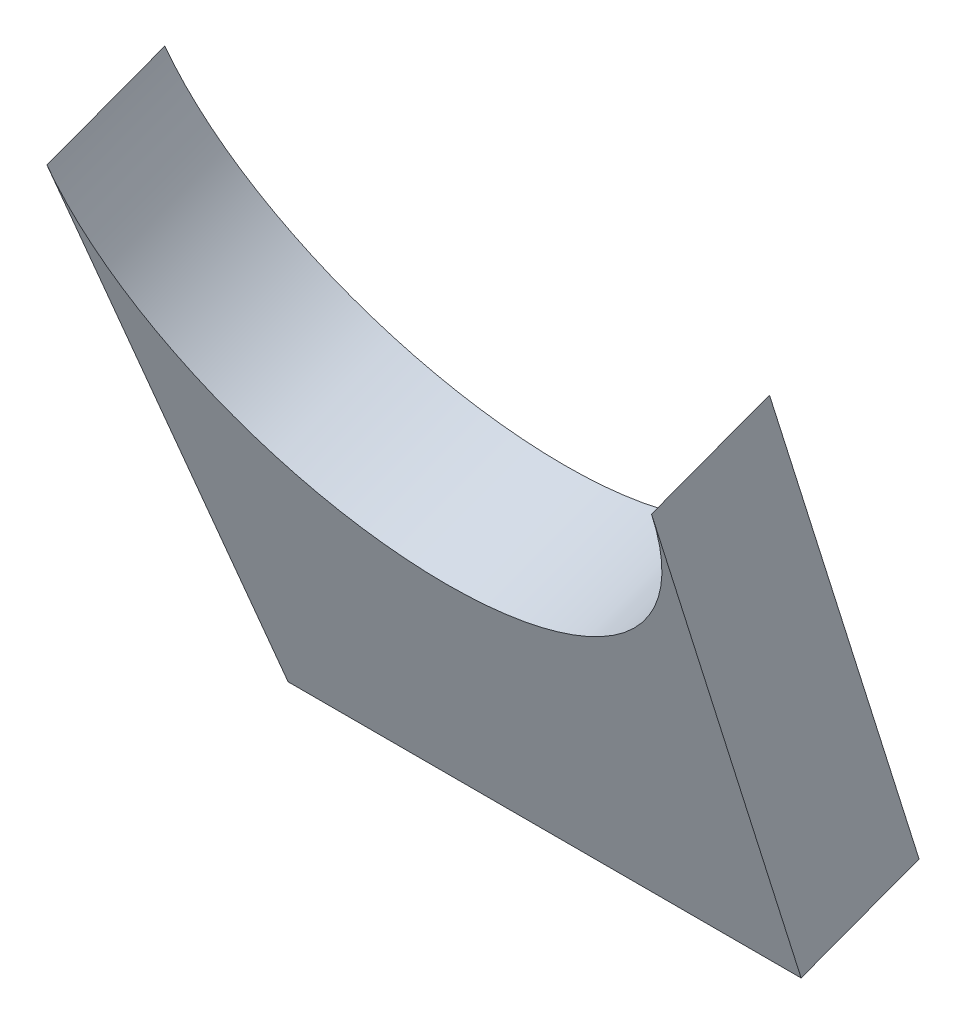
ISO-10303-21;
HEADER;
FILE_DESCRIPTION(('STEP AP214'),'2;1');
FILE_NAME('part.step','',(''),(''),'','','');
FILE_SCHEMA(('AUTOMOTIVE_DESIGN { 1 0 10303 214 1 1 1 1 }'));
ENDSEC;
DATA;
#1=APPLICATION_CONTEXT('core data for automotive mechanical design processes');
#2=APPLICATION_PROTOCOL_DEFINITION('international standard','automotive_design',2000,#1);
#3=PRODUCT_CONTEXT('',#1,'mechanical');
#4=PRODUCT('Part','Part','',(#3));
#5=PRODUCT_RELATED_PRODUCT_CATEGORY('part','',(#4));
#6=PRODUCT_DEFINITION_FORMATION('','',#4);
#7=PRODUCT_DEFINITION_CONTEXT('part definition',#1,'design');
#8=PRODUCT_DEFINITION('design','',#6,#7);
#9=PRODUCT_DEFINITION_SHAPE('','',#8);
#10=(LENGTH_UNIT() NAMED_UNIT(*) SI_UNIT(.MILLI.,.METRE.));
#11=(NAMED_UNIT(*) PLANE_ANGLE_UNIT() SI_UNIT($,.RADIAN.));
#12=(NAMED_UNIT(*) SI_UNIT($,.STERADIAN.) SOLID_ANGLE_UNIT());
#13=UNCERTAINTY_MEASURE_WITH_UNIT(LENGTH_MEASURE(1.E-05),#10,'distance_accuracy_value','');
#14=(GEOMETRIC_REPRESENTATION_CONTEXT(3) GLOBAL_UNCERTAINTY_ASSIGNED_CONTEXT((#13)) GLOBAL_UNIT_ASSIGNED_CONTEXT((#10,
#11,#12)) REPRESENTATION_CONTEXT('',''));
#15=CARTESIAN_POINT('',(0.,0.,0.));
#16=DIRECTION('',(0.,0.,1.));
#17=DIRECTION('',(1.,0.,0.));
#18=AXIS2_PLACEMENT_3D('',#15,#16,#17);
#19=CARTESIAN_POINT('',(146.851077593121,260.160265925278,283.033466300654));
#20=DIRECTION('',(0.,0.350357155200277,-0.936616177417393));
#21=DIRECTION('',(0.,0.936616177417393,0.350357155200277));
#22=AXIS2_PLACEMENT_3D('',#19,#20,#21);
#23=CYLINDRICAL_SURFACE('',#22,82.6030936471025);
#24=CARTESIAN_POINT('',(146.851077593121,272.174012777096,250.91689757701));
#25=DIRECTION('',(0.,0.350357155200277,-0.936616177417392));
#26=DIRECTION('',(0.,-0.936616177417392,-0.350357155200277));
#27=AXIS2_PLACEMENT_3D('',#24,#25,#26);
#28=CIRCLE('',#27,82.6030936471025);
#29=CARTESIAN_POINT('',(229.176924838274,265.840523361173,248.547748519206));
#30=VERTEX_POINT('',#29);
#31=CARTESIAN_POINT('',(64.525230347968,265.840523361174,248.547748519205));
#32=VERTEX_POINT('',#31);
#33=EDGE_CURVE('E95',#30,#32,#28,.T.);
#34=ORIENTED_EDGE('',*,*,#33,.T.);
#35=DIRECTION('',(0.,0.350357155200277,-0.936616177417393));
#36=VECTOR('',#35,1.);
#37=CARTESIAN_POINT('',(64.5252303479677,253.826776509357,280.664317242849));
#38=LINE('',#37,#36);
#39=CARTESIAN_POINT('',(64.5252303479677,253.826776509357,280.664317242849));
#40=VERTEX_POINT('',#39);
#41=EDGE_CURVE('E11',#40,#32,#38,.T.);
#42=ORIENTED_EDGE('',*,*,#41,.F.);
#43=CARTESIAN_POINT('',(146.851077593121,260.160265925278,283.033466300654));
#44=DIRECTION('',(0.,0.350357155200277,-0.936616177417392));
#45=DIRECTION('',(0.,-0.936616177417392,-0.350357155200277));
#46=AXIS2_PLACEMENT_3D('',#43,#44,#45);
#47=CIRCLE('',#46,82.6030936471025);
#48=CARTESIAN_POINT('',(229.176924838274,253.826776509356,280.664317242849));
#49=VERTEX_POINT('',#48);
#50=EDGE_CURVE('E83',#49,#40,#47,.T.);
#51=ORIENTED_EDGE('',*,*,#50,.F.);
#52=DIRECTION('',(0.,0.350357155200277,-0.936616177417393));
#53=VECTOR('',#52,1.);
#54=CARTESIAN_POINT('',(229.176924838274,253.826776509356,280.664317242849));
#55=LINE('',#54,#53);
#56=EDGE_CURVE('E91',#49,#30,#55,.T.);
#57=ORIENTED_EDGE('',*,*,#56,.T.);
#58=EDGE_LOOP('',(#34,#42,#51,#57));
#59=FACE_BOUND('',#58,.T.);
#60=ADVANCED_FACE('F32',(#59),#23,.F.);
#61=CARTESIAN_POINT('',(64.5252303479677,253.826776509357,280.664317242849));
#62=DIRECTION('',(0.99664363173692,0.0766737556220382,0.0286811177790371));
#63=DIRECTION('',(-0.0767053112573076,0.997053807587594,0.));
#64=AXIS2_PLACEMENT_3D('',#61,#62,#63);
#65=PLANE('',#64);
#66=DIRECTION('',(0.0818625147319763,-0.933472548604821,-0.34918122756382));
#67=VECTOR('',#66,1.);
#68=CARTESIAN_POINT('',(64.525230347968,265.840523361174,248.547748519205));
#69=LINE('',#68,#67);
#70=CARTESIAN_POINT('',(77.0010775931211,123.5793069538,195.332529438479));
#71=VERTEX_POINT('',#70);
#72=EDGE_CURVE('E87',#32,#71,#69,.T.);
#73=ORIENTED_EDGE('',*,*,#72,.T.);
#74=DIRECTION('',(0.,0.350357155200277,-0.936616177417393));
#75=VECTOR('',#74,1.);
#76=CARTESIAN_POINT('',(77.0010775931209,111.565560101982,227.449098162122));
#77=LINE('',#76,#75);
#78=CARTESIAN_POINT('',(77.0010775931209,111.565560101982,227.449098162122));
#79=VERTEX_POINT('',#78);
#80=EDGE_CURVE('E40',#79,#71,#77,.T.);
#81=ORIENTED_EDGE('',*,*,#80,.F.);
#82=DIRECTION('',(0.0818625147319763,-0.933472548604821,-0.34918122756382));
#83=VECTOR('',#82,1.);
#84=CARTESIAN_POINT('',(64.5252303479677,253.826776509357,280.664317242849));
#85=LINE('',#84,#83);
#86=EDGE_CURVE('E78',#40,#79,#85,.T.);
#87=ORIENTED_EDGE('',*,*,#86,.F.);
#88=ORIENTED_EDGE('',*,*,#41,.T.);
#89=EDGE_LOOP('',(#73,#81,#87,#88));
#90=FACE_BOUND('',#89,.T.);
#91=ADVANCED_FACE('F86',(#90),#65,.F.);
#92=CARTESIAN_POINT('',(77.0010775931209,111.565560101982,227.449098162122));
#93=DIRECTION('',(0.,0.936616177417393,0.350357155200277));
#94=DIRECTION('',(0.,-0.350357155200277,0.936616177417393));
#95=AXIS2_PLACEMENT_3D('',#92,#93,#94);
#96=PLANE('',#95);
#97=DIRECTION('',(1.,0.,0.));
#98=VECTOR('',#97,1.);
#99=CARTESIAN_POINT('',(77.0010775931211,123.5793069538,195.332529438479));
#100=LINE('',#99,#98);
#101=CARTESIAN_POINT('',(216.701077593121,123.579306953798,195.332529438479));
#102=VERTEX_POINT('',#101);
#103=EDGE_CURVE('E65',#71,#102,#100,.T.);
#104=ORIENTED_EDGE('',*,*,#103,.T.);
#105=DIRECTION('',(0.,0.350357155200277,-0.936616177417393));
#106=VECTOR('',#105,1.);
#107=CARTESIAN_POINT('',(216.701077593121,111.565560101981,227.449098162122));
#108=LINE('',#107,#106);
#109=CARTESIAN_POINT('',(216.701077593121,111.565560101981,227.449098162122));
#110=VERTEX_POINT('',#109);
#111=EDGE_CURVE('E88',#110,#102,#108,.T.);
#112=ORIENTED_EDGE('',*,*,#111,.F.);
#113=DIRECTION('',(1.,0.,0.));
#114=VECTOR('',#113,1.);
#115=CARTESIAN_POINT('',(77.0010775931209,111.565560101982,227.449098162122));
#116=LINE('',#115,#114);
#117=EDGE_CURVE('E81',#79,#110,#116,.T.);
#118=ORIENTED_EDGE('',*,*,#117,.F.);
#119=ORIENTED_EDGE('',*,*,#80,.T.);
#120=EDGE_LOOP('',(#104,#112,#118,#119));
#121=FACE_BOUND('',#120,.T.);
#122=ADVANCED_FACE('F89',(#121),#96,.F.);
#123=CARTESIAN_POINT('',(216.701077593121,111.565560101981,227.449098162122));
#124=DIRECTION('',(-0.99664363173692,0.0766737556220388,0.0286811177790348));
#125=DIRECTION('',(-0.0767053112573083,-0.997053807587594,0.));
#126=AXIS2_PLACEMENT_3D('',#123,#124,#125);
#127=PLANE('',#126);
#128=DIRECTION('',(0.0818625147319761,0.933472548604821,0.34918122756382));
#129=VECTOR('',#128,1.);
#130=CARTESIAN_POINT('',(216.701077593121,123.579306953798,195.332529438479));
#131=LINE('',#130,#129);
#132=EDGE_CURVE('E71',#102,#30,#131,.T.);
#133=ORIENTED_EDGE('',*,*,#132,.T.);
#134=ORIENTED_EDGE('',*,*,#56,.F.);
#135=DIRECTION('',(0.0818625147319761,0.933472548604821,0.34918122756382));
#136=VECTOR('',#135,1.);
#137=CARTESIAN_POINT('',(216.701077593121,111.565560101981,227.449098162122));
#138=LINE('',#137,#136);
#139=EDGE_CURVE('E48',#110,#49,#138,.T.);
#140=ORIENTED_EDGE('',*,*,#139,.F.);
#141=ORIENTED_EDGE('',*,*,#111,.T.);
#142=EDGE_LOOP('',(#133,#134,#140,#141));
#143=FACE_BOUND('',#142,.T.);
#144=ADVANCED_FACE('F102',(#143),#127,.F.);
#145=CARTESIAN_POINT('',(146.851077593121,260.160265925278,283.033466300654));
#146=DIRECTION('',(0.,-0.350357155200277,0.936616177417392));
#147=DIRECTION('',(0.,-0.936616177417392,-0.350357155200277));
#148=AXIS2_PLACEMENT_3D('',#145,#146,#147);
#149=PLANE('',#148);
#150=ORIENTED_EDGE('',*,*,#50,.T.);
#151=ORIENTED_EDGE('',*,*,#86,.T.);
#152=ORIENTED_EDGE('',*,*,#117,.T.);
#153=ORIENTED_EDGE('',*,*,#139,.T.);
#154=EDGE_LOOP('',(#150,#151,#152,#153));
#155=FACE_BOUND('',#154,.T.);
#156=ADVANCED_FACE('F79',(#155),#149,.T.);
#157=CARTESIAN_POINT('',(146.851077593121,272.174012777096,250.91689757701));
#158=DIRECTION('',(0.,-0.350357155200277,0.936616177417392));
#159=DIRECTION('',(0.,-0.936616177417392,-0.350357155200277));
#160=AXIS2_PLACEMENT_3D('',#157,#158,#159);
#161=PLANE('',#160);
#162=ORIENTED_EDGE('',*,*,#33,.F.);
#163=ORIENTED_EDGE('',*,*,#132,.F.);
#164=ORIENTED_EDGE('',*,*,#103,.F.);
#165=ORIENTED_EDGE('',*,*,#72,.F.);
#166=EDGE_LOOP('',(#162,#163,#164,#165));
#167=FACE_BOUND('',#166,.T.);
#168=ADVANCED_FACE('F105',(#167),#161,.F.);
#169=CLOSED_SHELL('',(#60,#91,#122,#144,#156,#168));
#170=MANIFOLD_SOLID_BREP('B2',#169);
#171=ADVANCED_BREP_SHAPE_REPRESENTATION('',(#18,#170),#14);
#172=SHAPE_DEFINITION_REPRESENTATION(#9,#171);
ENDSEC;
END-ISO-10303-21;
